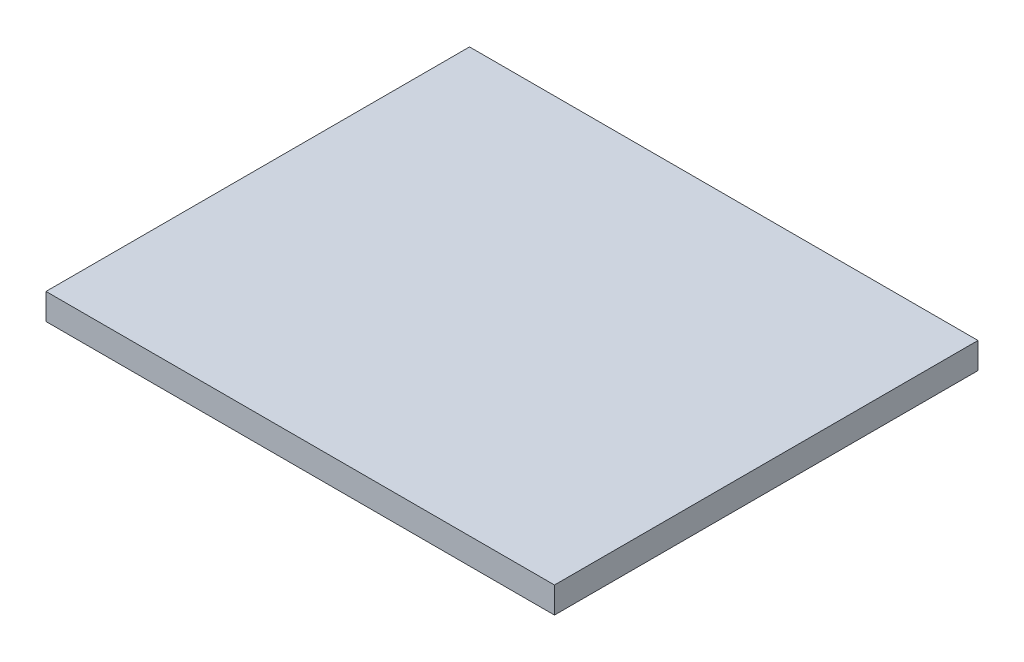
ISO-10303-21;
HEADER;
FILE_DESCRIPTION(('STEP AP214'),'2;1');
FILE_NAME('part.step','',(''),(''),'','','');
FILE_SCHEMA(('AUTOMOTIVE_DESIGN { 1 0 10303 214 1 1 1 1 }'));
ENDSEC;
DATA;
#1=APPLICATION_CONTEXT('core data for automotive mechanical design processes');
#2=APPLICATION_PROTOCOL_DEFINITION('international standard','automotive_design',2000,#1);
#3=PRODUCT_CONTEXT('',#1,'mechanical');
#4=PRODUCT('Part','Part','',(#3));
#5=PRODUCT_RELATED_PRODUCT_CATEGORY('part','',(#4));
#6=PRODUCT_DEFINITION_FORMATION('','',#4);
#7=PRODUCT_DEFINITION_CONTEXT('part definition',#1,'design');
#8=PRODUCT_DEFINITION('design','',#6,#7);
#9=PRODUCT_DEFINITION_SHAPE('','',#8);
#10=(LENGTH_UNIT() NAMED_UNIT(*) SI_UNIT(.MILLI.,.METRE.));
#11=(NAMED_UNIT(*) PLANE_ANGLE_UNIT() SI_UNIT($,.RADIAN.));
#12=(NAMED_UNIT(*) SI_UNIT($,.STERADIAN.) SOLID_ANGLE_UNIT());
#13=UNCERTAINTY_MEASURE_WITH_UNIT(LENGTH_MEASURE(1.E-05),#10,'distance_accuracy_value','');
#14=(GEOMETRIC_REPRESENTATION_CONTEXT(3) GLOBAL_UNCERTAINTY_ASSIGNED_CONTEXT((#13)) GLOBAL_UNIT_ASSIGNED_CONTEXT((#10,
#11,#12)) REPRESENTATION_CONTEXT('',''));
#15=CARTESIAN_POINT('',(0.,0.,0.));
#16=DIRECTION('',(0.,0.,1.));
#17=DIRECTION('',(1.,0.,0.));
#18=AXIS2_PLACEMENT_3D('',#15,#16,#17);
#19=CARTESIAN_POINT('',(-0.424999999999999,0.01,-3.42500000000005));
#20=DIRECTION('',(0.,0.,-1.));
#21=DIRECTION('',(-1.,0.,0.));
#22=AXIS2_PLACEMENT_3D('',#19,#20,#21);
#23=PLANE('',#22);
#24=DIRECTION('',(1.,0.,0.));
#25=VECTOR('',#24,1.);
#26=CARTESIAN_POINT('',(-0.424999999999999,0.,-3.42500000000005));
#27=LINE('',#26,#25);
#28=CARTESIAN_POINT('',(-0.424999999999999,0.,-3.42500000000005));
#29=VERTEX_POINT('',#28);
#30=CARTESIAN_POINT('',(2.625,0.,-3.42500000000005));
#31=VERTEX_POINT('',#30);
#32=EDGE_CURVE('E122',#29,#31,#27,.T.);
#33=ORIENTED_EDGE('',*,*,#32,.F.);
#34=DIRECTION('',(0.,-1.,0.));
#35=VECTOR('',#34,1.);
#36=CARTESIAN_POINT('',(-0.424999999999999,0.01,-3.42500000000005));
#37=LINE('',#36,#35);
#38=CARTESIAN_POINT('',(-0.424999999999999,0.01,-3.42500000000005));
#39=VERTEX_POINT('',#38);
#40=EDGE_CURVE('E11',#39,#29,#37,.T.);
#41=ORIENTED_EDGE('',*,*,#40,.F.);
#42=DIRECTION('',(1.,0.,0.));
#43=VECTOR('',#42,1.);
#44=CARTESIAN_POINT('',(-0.424999999999999,0.01,-3.42500000000005));
#45=LINE('',#44,#43);
#46=CARTESIAN_POINT('',(2.625,0.01,-3.42500000000005));
#47=VERTEX_POINT('',#46);
#48=EDGE_CURVE('E83',#39,#47,#45,.T.);
#49=ORIENTED_EDGE('',*,*,#48,.T.);
#50=DIRECTION('',(0.,-1.,0.));
#51=VECTOR('',#50,1.);
#52=CARTESIAN_POINT('',(2.625,0.01,-3.42500000000005));
#53=LINE('',#52,#51);
#54=EDGE_CURVE('E36',#47,#31,#53,.T.);
#55=ORIENTED_EDGE('',*,*,#54,.T.);
#56=EDGE_LOOP('',(#33,#41,#49,#55));
#57=FACE_BOUND('',#56,.T.);
#58=ADVANCED_FACE('F33',(#57),#23,.T.);
#59=CARTESIAN_POINT('',(-0.424999999999999,0.01,-3.42500000000005));
#60=DIRECTION('',(1.,0.,0.));
#61=DIRECTION('',(0.,0.,-1.));
#62=AXIS2_PLACEMENT_3D('',#59,#60,#61);
#63=PLANE('',#62);
#64=DIRECTION('',(0.,0.,1.));
#65=VECTOR('',#64,1.);
#66=CARTESIAN_POINT('',(-0.424999999999999,0.,-3.42500000000005));
#67=LINE('',#66,#65);
#68=CARTESIAN_POINT('',(-0.424999999999998,0.,3.42499999999996));
#69=VERTEX_POINT('',#68);
#70=EDGE_CURVE('E72',#29,#69,#67,.T.);
#71=ORIENTED_EDGE('',*,*,#70,.T.);
#72=DIRECTION('',(0.,-1.,0.));
#73=VECTOR('',#72,1.);
#74=CARTESIAN_POINT('',(-0.424999999999998,0.01,3.42499999999996));
#75=LINE('',#74,#73);
#76=CARTESIAN_POINT('',(-0.424999999999998,0.01,3.42499999999996));
#77=VERTEX_POINT('',#76);
#78=EDGE_CURVE('E42',#77,#69,#75,.T.);
#79=ORIENTED_EDGE('',*,*,#78,.F.);
#80=DIRECTION('',(0.,0.,1.));
#81=VECTOR('',#80,1.);
#82=CARTESIAN_POINT('',(-0.424999999999999,0.01,-3.42500000000005));
#83=LINE('',#82,#81);
#84=EDGE_CURVE('E111',#39,#77,#83,.T.);
#85=ORIENTED_EDGE('',*,*,#84,.F.);
#86=ORIENTED_EDGE('',*,*,#40,.T.);
#87=EDGE_LOOP('',(#71,#79,#85,#86));
#88=FACE_BOUND('',#87,.T.);
#89=ADVANCED_FACE('F74',(#88),#63,.F.);
#90=CARTESIAN_POINT('',(-0.424999999999998,0.01,3.42499999999996));
#91=DIRECTION('',(0.,0.,-1.));
#92=DIRECTION('',(-1.,0.,0.));
#93=AXIS2_PLACEMENT_3D('',#90,#91,#92);
#94=PLANE('',#93);
#95=DIRECTION('',(1.,0.,0.));
#96=VECTOR('',#95,1.);
#97=CARTESIAN_POINT('',(-0.424999999999998,0.,3.42499999999996));
#98=LINE('',#97,#96);
#99=CARTESIAN_POINT('',(4.125,0.,3.42499999999996));
#100=VERTEX_POINT('',#99);
#101=EDGE_CURVE('E84',#69,#100,#98,.T.);
#102=ORIENTED_EDGE('',*,*,#101,.T.);
#103=DIRECTION('',(0.,-1.,0.));
#104=VECTOR('',#103,1.);
#105=CARTESIAN_POINT('',(4.125,0.01,3.42499999999996));
#106=LINE('',#105,#104);
#107=CARTESIAN_POINT('',(4.125,0.01,3.42499999999996));
#108=VERTEX_POINT('',#107);
#109=EDGE_CURVE('E93',#108,#100,#106,.T.);
#110=ORIENTED_EDGE('',*,*,#109,.F.);
#111=DIRECTION('',(1.,0.,0.));
#112=VECTOR('',#111,1.);
#113=CARTESIAN_POINT('',(-0.424999999999998,0.01,3.42499999999996));
#114=LINE('',#113,#112);
#115=EDGE_CURVE('E92',#77,#108,#114,.T.);
#116=ORIENTED_EDGE('',*,*,#115,.F.);
#117=ORIENTED_EDGE('',*,*,#78,.T.);
#118=EDGE_LOOP('',(#102,#110,#116,#117));
#119=FACE_BOUND('',#118,.T.);
#120=ADVANCED_FACE('F88',(#119),#94,.F.);
#121=CARTESIAN_POINT('',(4.125,0.01,-0.42500000000005));
#122=DIRECTION('',(1.,0.,0.));
#123=DIRECTION('',(0.,0.,-1.));
#124=AXIS2_PLACEMENT_3D('',#121,#122,#123);
#125=PLANE('',#124);
#126=DIRECTION('',(0.,0.,1.));
#127=VECTOR('',#126,1.);
#128=CARTESIAN_POINT('',(4.125,0.,-0.42500000000005));
#129=LINE('',#128,#127);
#130=CARTESIAN_POINT('',(4.125,0.,-0.42500000000005));
#131=VERTEX_POINT('',#130);
#132=EDGE_CURVE('E98',#131,#100,#129,.T.);
#133=ORIENTED_EDGE('',*,*,#132,.F.);
#134=DIRECTION('',(0.,-1.,0.));
#135=VECTOR('',#134,1.);
#136=CARTESIAN_POINT('',(4.125,0.01,-0.42500000000005));
#137=LINE('',#136,#135);
#138=CARTESIAN_POINT('',(4.125,0.01,-0.42500000000005));
#139=VERTEX_POINT('',#138);
#140=EDGE_CURVE('E105',#139,#131,#137,.T.);
#141=ORIENTED_EDGE('',*,*,#140,.F.);
#142=DIRECTION('',(0.,0.,1.));
#143=VECTOR('',#142,1.);
#144=CARTESIAN_POINT('',(4.125,0.01,-0.42500000000005));
#145=LINE('',#144,#143);
#146=EDGE_CURVE('E118',#139,#108,#145,.T.);
#147=ORIENTED_EDGE('',*,*,#146,.T.);
#148=ORIENTED_EDGE('',*,*,#109,.T.);
#149=EDGE_LOOP('',(#133,#141,#147,#148));
#150=FACE_BOUND('',#149,.T.);
#151=ADVANCED_FACE('F133',(#150),#125,.T.);
#152=CARTESIAN_POINT('',(2.625,0.01,-0.42500000000005));
#153=DIRECTION('',(0.,0.,-1.));
#154=DIRECTION('',(-1.,0.,0.));
#155=AXIS2_PLACEMENT_3D('',#152,#153,#154);
#156=PLANE('',#155);
#157=DIRECTION('',(1.,0.,0.));
#158=VECTOR('',#157,1.);
#159=CARTESIAN_POINT('',(2.625,0.,-0.42500000000005));
#160=LINE('',#159,#158);
#161=CARTESIAN_POINT('',(2.625,0.,-0.42500000000005));
#162=VERTEX_POINT('',#161);
#163=EDGE_CURVE('E100',#162,#131,#160,.T.);
#164=ORIENTED_EDGE('',*,*,#163,.F.);
#165=DIRECTION('',(0.,-1.,0.));
#166=VECTOR('',#165,1.);
#167=CARTESIAN_POINT('',(2.625,0.01,-0.42500000000005));
#168=LINE('',#167,#166);
#169=CARTESIAN_POINT('',(2.625,0.01,-0.42500000000005));
#170=VERTEX_POINT('',#169);
#171=EDGE_CURVE('E106',#170,#162,#168,.T.);
#172=ORIENTED_EDGE('',*,*,#171,.F.);
#173=DIRECTION('',(1.,0.,0.));
#174=VECTOR('',#173,1.);
#175=CARTESIAN_POINT('',(2.625,0.01,-0.42500000000005));
#176=LINE('',#175,#174);
#177=EDGE_CURVE('E50',#170,#139,#176,.T.);
#178=ORIENTED_EDGE('',*,*,#177,.T.);
#179=ORIENTED_EDGE('',*,*,#140,.T.);
#180=EDGE_LOOP('',(#164,#172,#178,#179));
#181=FACE_BOUND('',#180,.T.);
#182=ADVANCED_FACE('F128',(#181),#156,.T.);
#183=CARTESIAN_POINT('',(2.625,0.01,-3.42500000000005));
#184=DIRECTION('',(1.,0.,0.));
#185=DIRECTION('',(0.,0.,-1.));
#186=AXIS2_PLACEMENT_3D('',#183,#184,#185);
#187=PLANE('',#186);
#188=DIRECTION('',(0.,0.,1.));
#189=VECTOR('',#188,1.);
#190=CARTESIAN_POINT('',(2.625,0.,-3.42500000000005));
#191=LINE('',#190,#189);
#192=EDGE_CURVE('E124',#31,#162,#191,.T.);
#193=ORIENTED_EDGE('',*,*,#192,.F.);
#194=ORIENTED_EDGE('',*,*,#54,.F.);
#195=DIRECTION('',(0.,0.,1.));
#196=VECTOR('',#195,1.);
#197=CARTESIAN_POINT('',(2.625,0.01,-3.42500000000005));
#198=LINE('',#197,#196);
#199=EDGE_CURVE('E196',#47,#170,#198,.T.);
#200=ORIENTED_EDGE('',*,*,#199,.T.);
#201=ORIENTED_EDGE('',*,*,#171,.T.);
#202=EDGE_LOOP('',(#193,#194,#200,#201));
#203=FACE_BOUND('',#202,.T.);
#204=ADVANCED_FACE('F198',(#203),#187,.T.);
#205=CARTESIAN_POINT('',(0.,0.,0.));
#206=DIRECTION('',(0.,-1.,0.));
#207=DIRECTION('',(0.,0.,-1.));
#208=AXIS2_PLACEMENT_3D('',#205,#206,#207);
#209=PLANE('',#208);
#210=ORIENTED_EDGE('',*,*,#32,.T.);
#211=ORIENTED_EDGE('',*,*,#192,.T.);
#212=ORIENTED_EDGE('',*,*,#163,.T.);
#213=ORIENTED_EDGE('',*,*,#132,.T.);
#214=ORIENTED_EDGE('',*,*,#101,.F.);
#215=ORIENTED_EDGE('',*,*,#70,.F.);
#216=EDGE_LOOP('',(#210,#211,#212,#213,#214,#215));
#217=FACE_BOUND('',#216,.T.);
#218=ADVANCED_FACE('F95',(#217),#209,.T.);
#219=CARTESIAN_POINT('',(-4.19,0.44,-3.49000000000005));
#220=DIRECTION('',(1.,0.,0.));
#221=DIRECTION('',(0.,0.,-1.));
#222=AXIS2_PLACEMENT_3D('',#219,#220,#221);
#223=PLANE('',#222);
#224=DIRECTION('',(0.,0.,1.));
#225=VECTOR('',#224,1.);
#226=CARTESIAN_POINT('',(-4.19,0.01,-3.49000000000005));
#227=LINE('',#226,#225);
#228=CARTESIAN_POINT('',(-4.19,0.01,-3.49000000000005));
#229=VERTEX_POINT('',#228);
#230=CARTESIAN_POINT('',(-4.19,0.01,3.48999999999995));
#231=VERTEX_POINT('',#230);
#232=EDGE_CURVE('E321',#229,#231,#227,.T.);
#233=ORIENTED_EDGE('',*,*,#232,.T.);
#234=DIRECTION('',(0.,-1.,0.));
#235=VECTOR('',#234,1.);
#236=CARTESIAN_POINT('',(-4.19,0.44,3.48999999999995));
#237=LINE('',#236,#235);
#238=CARTESIAN_POINT('',(-4.19,0.44,3.48999999999995));
#239=VERTEX_POINT('',#238);
#240=EDGE_CURVE('E172',#239,#231,#237,.T.);
#241=ORIENTED_EDGE('',*,*,#240,.F.);
#242=DIRECTION('',(0.,0.,1.));
#243=VECTOR('',#242,1.);
#244=CARTESIAN_POINT('',(-4.19,0.44,-3.49000000000005));
#245=LINE('',#244,#243);
#246=CARTESIAN_POINT('',(-4.19,0.44,-3.49000000000005));
#247=VERTEX_POINT('',#246);
#248=EDGE_CURVE('E166',#247,#239,#245,.T.);
#249=ORIENTED_EDGE('',*,*,#248,.F.);
#250=DIRECTION('',(0.,-1.,0.));
#251=VECTOR('',#250,1.);
#252=CARTESIAN_POINT('',(-4.19,0.44,-3.49000000000005));
#253=LINE('',#252,#251);
#254=EDGE_CURVE('E125',#247,#229,#253,.T.);
#255=ORIENTED_EDGE('',*,*,#254,.T.);
#256=EDGE_LOOP('',(#233,#241,#249,#255));
#257=FACE_BOUND('',#256,.T.);
#258=ADVANCED_FACE('F169',(#257),#223,.F.);
#259=CARTESIAN_POINT('',(0.,0.44,3.48999999999995));
#260=DIRECTION('',(0.,0.,-1.));
#261=DIRECTION('',(-1.,0.,0.));
#262=AXIS2_PLACEMENT_3D('',#259,#260,#261);
#263=PLANE('',#262);
#264=DIRECTION('',(1.,0.,0.));
#265=VECTOR('',#264,1.);
#266=CARTESIAN_POINT('',(0.,0.01,3.48999999999995));
#267=LINE('',#266,#265);
#268=CARTESIAN_POINT('',(4.19,0.01,3.48999999999995));
#269=VERTEX_POINT('',#268);
#270=EDGE_CURVE('E318',#231,#269,#267,.T.);
#271=ORIENTED_EDGE('',*,*,#270,.T.);
#272=DIRECTION('',(0.,-1.,0.));
#273=VECTOR('',#272,1.);
#274=CARTESIAN_POINT('',(4.19,0.44,3.48999999999995));
#275=LINE('',#274,#273);
#276=CARTESIAN_POINT('',(4.19,0.44,3.48999999999995));
#277=VERTEX_POINT('',#276);
#278=EDGE_CURVE('E191',#277,#269,#275,.T.);
#279=ORIENTED_EDGE('',*,*,#278,.F.);
#280=DIRECTION('',(1.,0.,0.));
#281=VECTOR('',#280,1.);
#282=CARTESIAN_POINT('',(-4.19,0.44,3.48999999999995));
#283=LINE('',#282,#281);
#284=EDGE_CURVE('E175',#239,#277,#283,.T.);
#285=ORIENTED_EDGE('',*,*,#284,.F.);
#286=ORIENTED_EDGE('',*,*,#240,.T.);
#287=EDGE_LOOP('',(#271,#279,#285,#286));
#288=FACE_BOUND('',#287,.T.);
#289=ADVANCED_FACE('F223',(#288),#263,.F.);
#290=CARTESIAN_POINT('',(4.19,0.44,3.48999999999995));
#291=DIRECTION('',(-1.,0.,0.));
#292=DIRECTION('',(0.,0.,1.));
#293=AXIS2_PLACEMENT_3D('',#290,#291,#292);
#294=PLANE('',#293);
#295=DIRECTION('',(0.,0.,-1.));
#296=VECTOR('',#295,1.);
#297=CARTESIAN_POINT('',(4.19,0.01,3.48999999999995));
#298=LINE('',#297,#296);
#299=CARTESIAN_POINT('',(4.19,0.01,-3.49000000000005));
#300=VERTEX_POINT('',#299);
#301=EDGE_CURVE('E315',#269,#300,#298,.T.);
#302=ORIENTED_EDGE('',*,*,#301,.T.);
#303=DIRECTION('',(0.,-1.,0.));
#304=VECTOR('',#303,1.);
#305=CARTESIAN_POINT('',(4.19,0.44,-3.49000000000005));
#306=LINE('',#305,#304);
#307=CARTESIAN_POINT('',(4.19,0.44,-3.49000000000005));
#308=VERTEX_POINT('',#307);
#309=EDGE_CURVE('E316',#308,#300,#306,.T.);
#310=ORIENTED_EDGE('',*,*,#309,.F.);
#311=DIRECTION('',(0.,0.,-1.));
#312=VECTOR('',#311,1.);
#313=CARTESIAN_POINT('',(4.19,0.44,3.48999999999995));
#314=LINE('',#313,#312);
#315=EDGE_CURVE('E181',#277,#308,#314,.T.);
#316=ORIENTED_EDGE('',*,*,#315,.F.);
#317=ORIENTED_EDGE('',*,*,#278,.T.);
#318=EDGE_LOOP('',(#302,#310,#316,#317));
#319=FACE_BOUND('',#318,.T.);
#320=ADVANCED_FACE('F227',(#319),#294,.F.);
#321=CARTESIAN_POINT('',(4.19,0.44,-3.49000000000005));
#322=DIRECTION('',(0.,0.,1.));
#323=DIRECTION('',(1.,0.,0.));
#324=AXIS2_PLACEMENT_3D('',#321,#322,#323);
#325=PLANE('',#324);
#326=DIRECTION('',(-1.,0.,0.));
#327=VECTOR('',#326,1.);
#328=CARTESIAN_POINT('',(4.19,0.01,-3.49000000000005));
#329=LINE('',#328,#327);
#330=EDGE_CURVE('E185',#300,#229,#329,.T.);
#331=ORIENTED_EDGE('',*,*,#330,.T.);
#332=ORIENTED_EDGE('',*,*,#254,.F.);
#333=DIRECTION('',(-1.,0.,0.));
#334=VECTOR('',#333,1.);
#335=CARTESIAN_POINT('',(0.,0.44,-3.49000000000005));
#336=LINE('',#335,#334);
#337=EDGE_CURVE('E176',#308,#247,#336,.T.);
#338=ORIENTED_EDGE('',*,*,#337,.F.);
#339=ORIENTED_EDGE('',*,*,#309,.T.);
#340=EDGE_LOOP('',(#331,#332,#338,#339));
#341=FACE_BOUND('',#340,.T.);
#342=ADVANCED_FACE('F187',(#341),#325,.F.);
#343=CARTESIAN_POINT('',(0.,0.44,0.));
#344=DIRECTION('',(0.,1.,0.));
#345=DIRECTION('',(0.,0.,1.));
#346=AXIS2_PLACEMENT_3D('',#343,#344,#345);
#347=PLANE('',#346);
#348=ORIENTED_EDGE('',*,*,#337,.T.);
#349=ORIENTED_EDGE('',*,*,#248,.T.);
#350=ORIENTED_EDGE('',*,*,#284,.T.);
#351=ORIENTED_EDGE('',*,*,#315,.T.);
#352=EDGE_LOOP('',(#348,#349,#350,#351));
#353=FACE_BOUND('',#352,.T.);
#354=ADVANCED_FACE('F179',(#353),#347,.T.);
#355=CARTESIAN_POINT('',(0.,0.01,0.));
#356=DIRECTION('',(0.,1.,0.));
#357=DIRECTION('',(0.,0.,1.));
#358=AXIS2_PLACEMENT_3D('',#355,#356,#357);
#359=PLANE('',#358);
#360=ORIENTED_EDGE('',*,*,#48,.F.);
#361=ORIENTED_EDGE('',*,*,#84,.T.);
#362=ORIENTED_EDGE('',*,*,#115,.T.);
#363=ORIENTED_EDGE('',*,*,#146,.F.);
#364=ORIENTED_EDGE('',*,*,#177,.F.);
#365=ORIENTED_EDGE('',*,*,#199,.F.);
#366=EDGE_LOOP('',(#360,#361,#362,#363,#364,#365));
#367=FACE_BOUND('',#366,.T.);
#368=ORIENTED_EDGE('',*,*,#232,.F.);
#369=ORIENTED_EDGE('',*,*,#330,.F.);
#370=ORIENTED_EDGE('',*,*,#301,.F.);
#371=ORIENTED_EDGE('',*,*,#270,.F.);
#372=EDGE_LOOP('',(#368,#369,#370,#371));
#373=FACE_BOUND('',#372,.T.);
#374=ADVANCED_FACE('F199',(#367,#373),#359,.F.);
#375=CLOSED_SHELL('',(#58,#89,#120,#151,#182,#204,#218,#258,#289,#320,#342,#354,#374));
#376=MANIFOLD_SOLID_BREP('B2',#375);
#377=ADVANCED_BREP_SHAPE_REPRESENTATION('',(#18,#376),#14);
#378=SHAPE_DEFINITION_REPRESENTATION(#9,#377);
ENDSEC;
END-ISO-10303-21;
